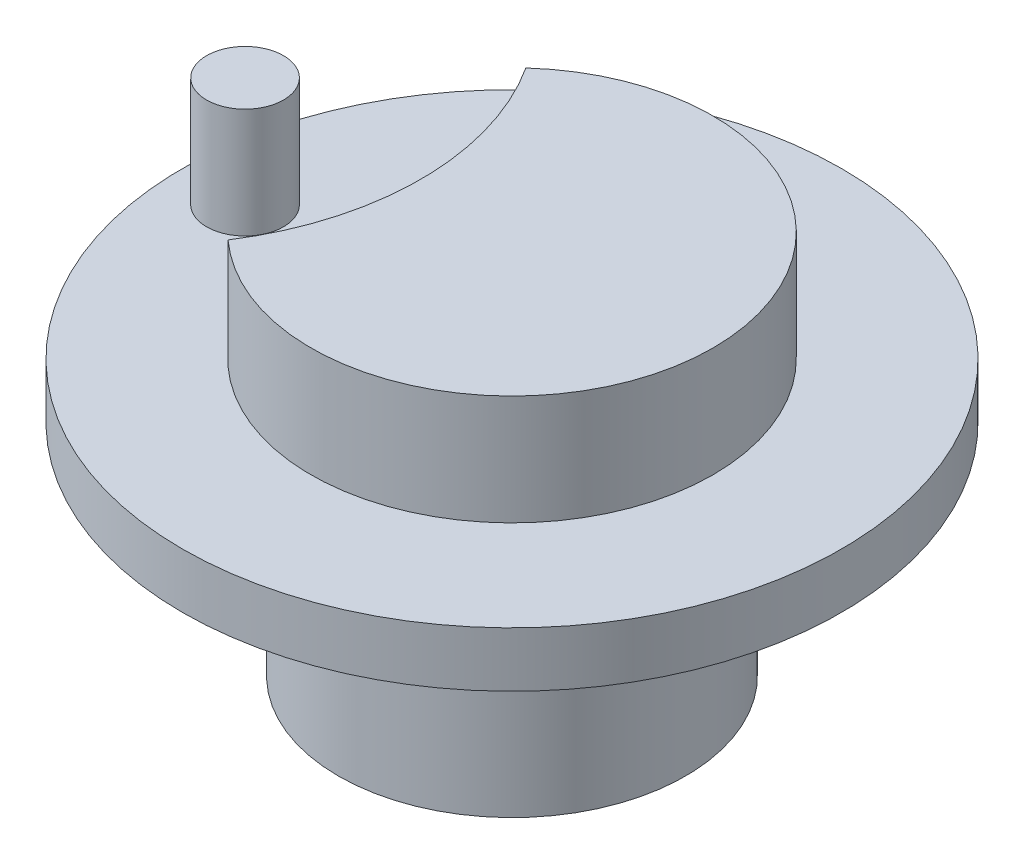
ISO-10303-21;
HEADER;
FILE_DESCRIPTION(('STEP AP214'),'2;1');
FILE_NAME('part.step','',(''),(''),'','','');
FILE_SCHEMA(('AUTOMOTIVE_DESIGN { 1 0 10303 214 1 1 1 1 }'));
ENDSEC;
DATA;
#1=APPLICATION_CONTEXT('core data for automotive mechanical design processes');
#2=APPLICATION_PROTOCOL_DEFINITION('international standard','automotive_design',2000,#1);
#3=PRODUCT_CONTEXT('',#1,'mechanical');
#4=PRODUCT('Part','Part','',(#3));
#5=PRODUCT_RELATED_PRODUCT_CATEGORY('part','',(#4));
#6=PRODUCT_DEFINITION_FORMATION('','',#4);
#7=PRODUCT_DEFINITION_CONTEXT('part definition',#1,'design');
#8=PRODUCT_DEFINITION('design','',#6,#7);
#9=PRODUCT_DEFINITION_SHAPE('','',#8);
#10=(LENGTH_UNIT() NAMED_UNIT(*) SI_UNIT(.MILLI.,.METRE.));
#11=(NAMED_UNIT(*) PLANE_ANGLE_UNIT() SI_UNIT($,.RADIAN.));
#12=(NAMED_UNIT(*) SI_UNIT($,.STERADIAN.) SOLID_ANGLE_UNIT());
#13=UNCERTAINTY_MEASURE_WITH_UNIT(LENGTH_MEASURE(1.E-05),#10,'distance_accuracy_value','');
#14=(GEOMETRIC_REPRESENTATION_CONTEXT(3) GLOBAL_UNCERTAINTY_ASSIGNED_CONTEXT((#13)) GLOBAL_UNIT_ASSIGNED_CONTEXT((#10,
#11,#12)) REPRESENTATION_CONTEXT('',''));
#15=CARTESIAN_POINT('',(0.,0.,0.));
#16=DIRECTION('',(0.,0.,1.));
#17=DIRECTION('',(1.,0.,0.));
#18=AXIS2_PLACEMENT_3D('',#15,#16,#17);
#19=CARTESIAN_POINT('',(0.,2.5,0.));
#20=DIRECTION('',(0.,-1.,0.));
#21=DIRECTION('',(0.,0.,-1.));
#22=AXIS2_PLACEMENT_3D('',#19,#20,#21);
#23=CYLINDRICAL_SURFACE('',#22,15.);
#24=CARTESIAN_POINT('',(0.,2.5,0.));
#25=DIRECTION('',(0.,1.,0.));
#26=DIRECTION('',(0.,0.,1.));
#27=AXIS2_PLACEMENT_3D('',#24,#25,#26);
#28=CIRCLE('',#27,15.);
#29=CARTESIAN_POINT('',(0.,2.5,15.));
#30=VERTEX_POINT('',#29);
#31=EDGE_CURVE('E41',#30,#30,#28,.T.);
#32=ORIENTED_EDGE('',*,*,#31,.F.);
#33=EDGE_LOOP('',(#32));
#34=FACE_BOUND('',#33,.T.);
#35=CARTESIAN_POINT('',(0.,0.,0.));
#36=DIRECTION('',(0.,1.,0.));
#37=DIRECTION('',(0.,0.,1.));
#38=AXIS2_PLACEMENT_3D('',#35,#36,#37);
#39=CIRCLE('',#38,15.);
#40=CARTESIAN_POINT('',(0.,0.,15.));
#41=VERTEX_POINT('',#40);
#42=EDGE_CURVE('E80',#41,#41,#39,.T.);
#43=ORIENTED_EDGE('',*,*,#42,.T.);
#44=EDGE_LOOP('',(#43));
#45=FACE_BOUND('',#44,.T.);
#46=ADVANCED_FACE('F34',(#34,#45),#23,.T.);
#47=CARTESIAN_POINT('',(0.,2.5,0.));
#48=DIRECTION('',(0.,1.,0.));
#49=DIRECTION('',(0.,0.,1.));
#50=AXIS2_PLACEMENT_3D('',#47,#48,#49);
#51=PLANE('',#50);
#52=CARTESIAN_POINT('',(-12.15,2.5,0.));
#53=DIRECTION('',(0.,1.,0.));
#54=DIRECTION('',(0.,0.,1.));
#55=AXIS2_PLACEMENT_3D('',#52,#53,#54);
#56=CIRCLE('',#55,1.75);
#57=CARTESIAN_POINT('',(-12.15,2.5,1.75));
#58=VERTEX_POINT('',#57);
#59=EDGE_CURVE('E181',#58,#58,#56,.T.);
#60=ORIENTED_EDGE('',*,*,#59,.F.);
#61=EDGE_LOOP('',(#60));
#62=FACE_BOUND('',#61,.T.);
#63=CARTESIAN_POINT('',(-16.65,2.5,0.));
#64=DIRECTION('',(0.,1.,0.));
#65=DIRECTION('',(0.,0.,1.));
#66=AXIS2_PLACEMENT_3D('',#63,#64,#65);
#67=CIRCLE('',#66,12.5);
#68=CARTESIAN_POINT('',(-6.146996996997,2.5,6.77767865267378));
#69=VERTEX_POINT('',#68);
#70=CARTESIAN_POINT('',(-6.146996996997,2.5,-6.77767865267378));
#71=VERTEX_POINT('',#70);
#72=EDGE_CURVE('E47',#69,#71,#67,.T.);
#73=ORIENTED_EDGE('',*,*,#72,.T.);
#74=CARTESIAN_POINT('',(0.,2.5,0.));
#75=DIRECTION('',(0.,1.,0.));
#76=DIRECTION('',(0.,0.,1.));
#77=AXIS2_PLACEMENT_3D('',#74,#75,#76);
#78=CIRCLE('',#77,9.15);
#79=EDGE_CURVE('E61',#69,#71,#78,.T.);
#80=ORIENTED_EDGE('',*,*,#79,.F.);
#81=EDGE_LOOP('',(#73,#80));
#82=FACE_BOUND('',#81,.T.);
#83=ORIENTED_EDGE('',*,*,#31,.T.);
#84=EDGE_LOOP('',(#83));
#85=FACE_BOUND('',#84,.T.);
#86=ADVANCED_FACE('F62',(#62,#82,#85),#51,.T.);
#87=CARTESIAN_POINT('',(0.,0.,0.));
#88=DIRECTION('',(0.,1.,0.));
#89=DIRECTION('',(0.,0.,1.));
#90=AXIS2_PLACEMENT_3D('',#87,#88,#89);
#91=PLANE('',#90);
#92=CARTESIAN_POINT('',(0.,0.,0.));
#93=DIRECTION('',(0.,1.,0.));
#94=DIRECTION('',(0.,0.,1.));
#95=AXIS2_PLACEMENT_3D('',#92,#93,#94);
#96=CIRCLE('',#95,7.9);
#97=CARTESIAN_POINT('',(0.,0.,7.9));
#98=VERTEX_POINT('',#97);
#99=EDGE_CURVE('E11',#98,#98,#96,.F.);
#100=ORIENTED_EDGE('',*,*,#99,.F.);
#101=EDGE_LOOP('',(#100));
#102=FACE_BOUND('',#101,.T.);
#103=ORIENTED_EDGE('',*,*,#42,.F.);
#104=EDGE_LOOP('',(#103));
#105=FACE_BOUND('',#104,.T.);
#106=ADVANCED_FACE('F86',(#102,#105),#91,.F.);
#107=CARTESIAN_POINT('',(0.,7.5,0.));
#108=DIRECTION('',(0.,-1.,0.));
#109=DIRECTION('',(0.,0.,-1.));
#110=AXIS2_PLACEMENT_3D('',#107,#108,#109);
#111=CYLINDRICAL_SURFACE('',#110,9.15);
#112=ORIENTED_EDGE('',*,*,#79,.T.);
#113=DIRECTION('',(0.,-1.,0.));
#114=VECTOR('',#113,1.);
#115=CARTESIAN_POINT('',(-6.146996996997,7.5,-6.77767865267378));
#116=LINE('',#115,#114);
#117=CARTESIAN_POINT('',(-6.146996996997,7.5,-6.77767865267378));
#118=VERTEX_POINT('',#117);
#119=EDGE_CURVE('E71',#118,#71,#116,.T.);
#120=ORIENTED_EDGE('',*,*,#119,.F.);
#121=CARTESIAN_POINT('',(0.,7.5,0.));
#122=DIRECTION('',(0.,1.,0.));
#123=DIRECTION('',(0.,0.,1.));
#124=AXIS2_PLACEMENT_3D('',#121,#122,#123);
#125=CIRCLE('',#124,9.15);
#126=CARTESIAN_POINT('',(-6.146996996997,7.5,6.77767865267378));
#127=VERTEX_POINT('',#126);
#128=EDGE_CURVE('E69',#127,#118,#125,.T.);
#129=ORIENTED_EDGE('',*,*,#128,.F.);
#130=DIRECTION('',(0.,-1.,0.));
#131=VECTOR('',#130,1.);
#132=CARTESIAN_POINT('',(-6.146996996997,7.5,6.77767865267378));
#133=LINE('',#132,#131);
#134=EDGE_CURVE('E55',#127,#69,#133,.T.);
#135=ORIENTED_EDGE('',*,*,#134,.T.);
#136=EDGE_LOOP('',(#112,#120,#129,#135));
#137=FACE_BOUND('',#136,.T.);
#138=ADVANCED_FACE('F68',(#137),#111,.T.);
#139=CARTESIAN_POINT('',(-16.65,7.5,0.));
#140=DIRECTION('',(0.,-1.,0.));
#141=DIRECTION('',(0.,0.,-1.));
#142=AXIS2_PLACEMENT_3D('',#139,#140,#141);
#143=CYLINDRICAL_SURFACE('',#142,12.5);
#144=ORIENTED_EDGE('',*,*,#72,.F.);
#145=ORIENTED_EDGE('',*,*,#134,.F.);
#146=CARTESIAN_POINT('',(-16.65,7.5,0.));
#147=DIRECTION('',(0.,1.,0.));
#148=DIRECTION('',(0.,0.,1.));
#149=AXIS2_PLACEMENT_3D('',#146,#147,#148);
#150=CIRCLE('',#149,12.5);
#151=EDGE_CURVE('E72',#127,#118,#150,.T.);
#152=ORIENTED_EDGE('',*,*,#151,.T.);
#153=ORIENTED_EDGE('',*,*,#119,.T.);
#154=EDGE_LOOP('',(#144,#145,#152,#153));
#155=FACE_BOUND('',#154,.T.);
#156=ADVANCED_FACE('F74',(#155),#143,.F.);
#157=CARTESIAN_POINT('',(-8.325,7.5,0.));
#158=DIRECTION('',(0.,1.,0.));
#159=DIRECTION('',(0.,0.,1.));
#160=AXIS2_PLACEMENT_3D('',#157,#158,#159);
#161=PLANE('',#160);
#162=ORIENTED_EDGE('',*,*,#128,.T.);
#163=ORIENTED_EDGE('',*,*,#151,.F.);
#164=EDGE_LOOP('',(#162,#163));
#165=FACE_BOUND('',#164,.T.);
#166=ADVANCED_FACE('F122',(#165),#161,.T.);
#167=CARTESIAN_POINT('',(-12.15,7.5,0.));
#168=DIRECTION('',(0.,-1.,0.));
#169=DIRECTION('',(0.,0.,-1.));
#170=AXIS2_PLACEMENT_3D('',#167,#168,#169);
#171=CYLINDRICAL_SURFACE('',#170,1.75);
#172=CARTESIAN_POINT('',(-12.15,7.5,0.));
#173=DIRECTION('',(0.,1.,0.));
#174=DIRECTION('',(0.,0.,1.));
#175=AXIS2_PLACEMENT_3D('',#172,#173,#174);
#176=CIRCLE('',#175,1.75);
#177=CARTESIAN_POINT('',(-12.15,7.5,1.75));
#178=VERTEX_POINT('',#177);
#179=EDGE_CURVE('E66',#178,#178,#176,.T.);
#180=ORIENTED_EDGE('',*,*,#179,.F.);
#181=EDGE_LOOP('',(#180));
#182=FACE_BOUND('',#181,.T.);
#183=ORIENTED_EDGE('',*,*,#59,.T.);
#184=EDGE_LOOP('',(#183));
#185=FACE_BOUND('',#184,.T.);
#186=ADVANCED_FACE('F131',(#182,#185),#171,.T.);
#187=CARTESIAN_POINT('',(-12.15,7.5,0.));
#188=DIRECTION('',(0.,1.,0.));
#189=DIRECTION('',(0.,0.,1.));
#190=AXIS2_PLACEMENT_3D('',#187,#188,#189);
#191=PLANE('',#190);
#192=ORIENTED_EDGE('',*,*,#179,.T.);
#193=EDGE_LOOP('',(#192));
#194=FACE_BOUND('',#193,.T.);
#195=ADVANCED_FACE('F141',(#194),#191,.T.);
#196=CARTESIAN_POINT('',(0.,-10.,0.));
#197=DIRECTION('',(0.,1.,0.));
#198=DIRECTION('',(0.,0.,1.));
#199=AXIS2_PLACEMENT_3D('',#196,#197,#198);
#200=CYLINDRICAL_SURFACE('',#199,7.9);
#201=CARTESIAN_POINT('',(0.,-10.,0.));
#202=DIRECTION('',(0.,-1.,0.));
#203=DIRECTION('',(0.,0.,-1.));
#204=AXIS2_PLACEMENT_3D('',#201,#202,#203);
#205=CIRCLE('',#204,7.9);
#206=CARTESIAN_POINT('',(0.,-10.,-7.9));
#207=VERTEX_POINT('',#206);
#208=EDGE_CURVE('E180',#207,#207,#205,.T.);
#209=ORIENTED_EDGE('',*,*,#208,.F.);
#210=EDGE_LOOP('',(#209));
#211=FACE_BOUND('',#210,.T.);
#212=ORIENTED_EDGE('',*,*,#99,.T.);
#213=EDGE_LOOP('',(#212));
#214=FACE_BOUND('',#213,.T.);
#215=ADVANCED_FACE('F150',(#211,#214),#200,.T.);
#216=CARTESIAN_POINT('',(0.,-10.,0.));
#217=DIRECTION('',(0.,-1.,0.));
#218=DIRECTION('',(0.,0.,-1.));
#219=AXIS2_PLACEMENT_3D('',#216,#217,#218);
#220=PLANE('',#219);
#221=ORIENTED_EDGE('',*,*,#208,.T.);
#222=EDGE_LOOP('',(#221));
#223=FACE_BOUND('',#222,.T.);
#224=ADVANCED_FACE('F164',(#223),#220,.T.);
#225=CLOSED_SHELL('',(#46,#86,#106,#138,#156,#166,#186,#195,#215,#224));
#226=MANIFOLD_SOLID_BREP('B2',#225);
#227=ADVANCED_BREP_SHAPE_REPRESENTATION('',(#18,#226),#14);
#228=SHAPE_DEFINITION_REPRESENTATION(#9,#227);
ENDSEC;
END-ISO-10303-21;
